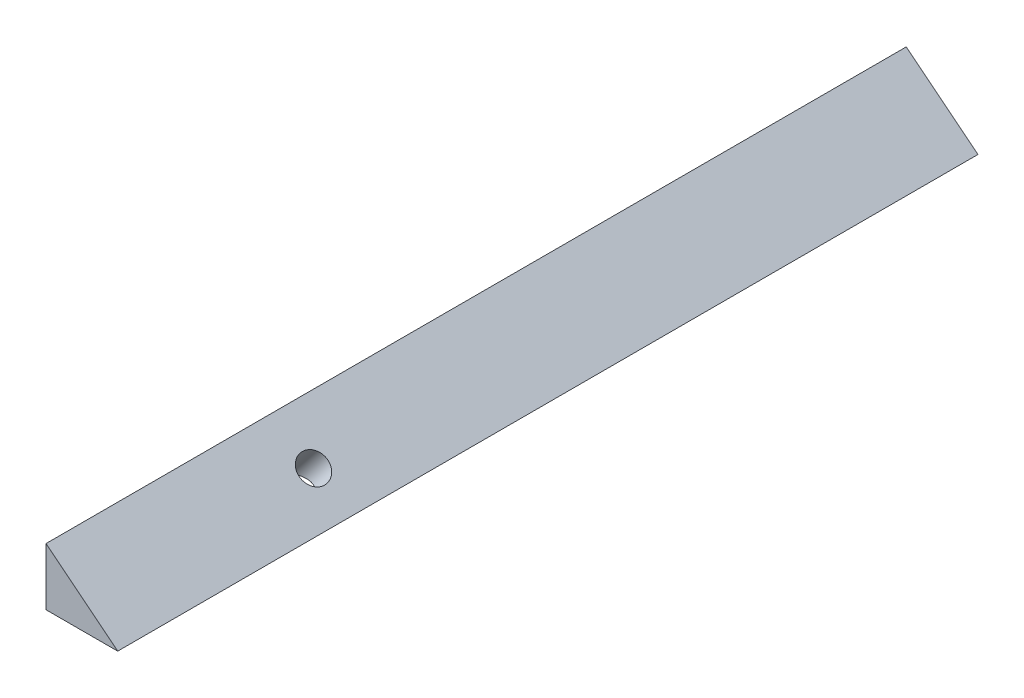
ISO-10303-21;
HEADER;
FILE_DESCRIPTION(('STEP AP214'),'2;1');
FILE_NAME('part.step','',(''),(''),'','','');
FILE_SCHEMA(('AUTOMOTIVE_DESIGN { 1 0 10303 214 1 1 1 1 }'));
ENDSEC;
DATA;
#1=APPLICATION_CONTEXT('core data for automotive mechanical design processes');
#2=APPLICATION_PROTOCOL_DEFINITION('international standard','automotive_design',2000,#1);
#3=PRODUCT_CONTEXT('',#1,'mechanical');
#4=PRODUCT('Part','Part','',(#3));
#5=PRODUCT_RELATED_PRODUCT_CATEGORY('part','',(#4));
#6=PRODUCT_DEFINITION_FORMATION('','',#4);
#7=PRODUCT_DEFINITION_CONTEXT('part definition',#1,'design');
#8=PRODUCT_DEFINITION('design','',#6,#7);
#9=PRODUCT_DEFINITION_SHAPE('','',#8);
#10=(LENGTH_UNIT() NAMED_UNIT(*) SI_UNIT(.MILLI.,.METRE.));
#11=(NAMED_UNIT(*) PLANE_ANGLE_UNIT() SI_UNIT($,.RADIAN.));
#12=(NAMED_UNIT(*) SI_UNIT($,.STERADIAN.) SOLID_ANGLE_UNIT());
#13=UNCERTAINTY_MEASURE_WITH_UNIT(LENGTH_MEASURE(1.E-05),#10,'distance_accuracy_value','');
#14=(GEOMETRIC_REPRESENTATION_CONTEXT(3) GLOBAL_UNCERTAINTY_ASSIGNED_CONTEXT((#13)) GLOBAL_UNIT_ASSIGNED_CONTEXT((#10,
#11,#12)) REPRESENTATION_CONTEXT('',''));
#15=CARTESIAN_POINT('',(0.,0.,0.));
#16=DIRECTION('',(0.,0.,1.));
#17=DIRECTION('',(1.,0.,0.));
#18=AXIS2_PLACEMENT_3D('',#15,#16,#17);
#19=CARTESIAN_POINT('',(0.,0.,-38.1));
#20=DIRECTION('',(1.,0.,0.));
#21=DIRECTION('',(0.,0.,-1.));
#22=AXIS2_PLACEMENT_3D('',#19,#20,#21);
#23=PLANE('',#22);
#24=DIRECTION('',(0.,0.,1.));
#25=VECTOR('',#24,1.);
#26=CARTESIAN_POINT('',(0.,0.,-38.1));
#27=LINE('',#26,#25);
#28=CARTESIAN_POINT('',(0.,0.,-469.9));
#29=VERTEX_POINT('',#28);
#30=CARTESIAN_POINT('',(0.,0.,83.4795863754));
#31=VERTEX_POINT('',#30);
#32=EDGE_CURVE('E93',#29,#31,#27,.T.);
#33=ORIENTED_EDGE('',*,*,#32,.T.);
#34=CARTESIAN_POINT('',(0.,-18.385241638452,88.9));
#35=DIRECTION('',(1.,0.,0.));
#36=DIRECTION('',(0.,1.,0.));
#37=AXIS2_PLACEMENT_3D('',#34,#35,#36);
#38=ELLIPSE('',#37,20.3299194538493,12.7);
#39=CARTESIAN_POINT('',(0.,0.,94.3204136245998));
#40=VERTEX_POINT('',#39);
#41=EDGE_CURVE('E60',#31,#40,#38,.T.);
#42=ORIENTED_EDGE('',*,*,#41,.T.);
#43=CARTESIAN_POINT('',(0.,0.,292.1));
#44=VERTEX_POINT('',#43);
#45=EDGE_CURVE('E90',#40,#44,#27,.T.);
#46=ORIENTED_EDGE('',*,*,#45,.T.);
#47=DIRECTION('',(0.,-1.,0.));
#48=VECTOR('',#47,1.);
#49=CARTESIAN_POINT('',(0.,50.8,292.1));
#50=LINE('',#49,#48);
#51=CARTESIAN_POINT('',(0.,50.8,292.1));
#52=VERTEX_POINT('',#51);
#53=EDGE_CURVE('E99',#52,#44,#50,.T.);
#54=ORIENTED_EDGE('',*,*,#53,.F.);
#55=DIRECTION('',(0.,0.,1.));
#56=VECTOR('',#55,1.);
#57=CARTESIAN_POINT('',(0.,50.8,-38.1));
#58=LINE('',#57,#56);
#59=CARTESIAN_POINT('',(0.,50.8,-469.9));
#60=VERTEX_POINT('',#59);
#61=EDGE_CURVE('E55',#60,#52,#58,.T.);
#62=ORIENTED_EDGE('',*,*,#61,.F.);
#63=DIRECTION('',(0.,1.,0.));
#64=VECTOR('',#63,1.);
#65=CARTESIAN_POINT('',(0.,0.,-469.9));
#66=LINE('',#65,#64);
#67=EDGE_CURVE('E94',#29,#60,#66,.T.);
#68=ORIENTED_EDGE('',*,*,#67,.F.);
#69=EDGE_LOOP('',(#33,#42,#46,#54,#62,#68));
#70=FACE_BOUND('',#69,.T.);
#71=ADVANCED_FACE('F48',(#70),#23,.F.);
#72=CARTESIAN_POINT('',(24.7804878048781,30.9756097560976,-38.1));
#73=DIRECTION('',(0.624695047554424,0.78086880944303,0.));
#74=DIRECTION('',(-0.78086880944303,0.624695047554424,0.));
#75=AXIS2_PLACEMENT_3D('',#72,#73,#74);
#76=PLANE('',#75);
#77=CARTESIAN_POINT('',(33.7488983602206,23.8008813118236,88.9));
#78=DIRECTION('',(0.624695047554424,0.78086880944303,0.));
#79=DIRECTION('',(-0.78086880944303,0.624695047554424,0.));
#80=AXIS2_PLACEMENT_3D('',#77,#78,#79);
#81=CIRCLE('',#80,12.7);
#82=CARTESIAN_POINT('',(23.8318644802941,31.7345084157648,88.9));
#83=VERTEX_POINT('',#82);
#84=EDGE_CURVE('E95',#83,#83,#81,.T.);
#85=ORIENTED_EDGE('',*,*,#84,.F.);
#86=EDGE_LOOP('',(#85));
#87=FACE_BOUND('',#86,.T.);
#88=ORIENTED_EDGE('',*,*,#61,.T.);
#89=DIRECTION('',(-0.78086880944303,0.624695047554424,0.));
#90=VECTOR('',#89,1.);
#91=CARTESIAN_POINT('',(63.5,0.,292.1));
#92=LINE('',#91,#90);
#93=CARTESIAN_POINT('',(63.5,0.,292.1));
#94=VERTEX_POINT('',#93);
#95=EDGE_CURVE('E105',#94,#52,#92,.T.);
#96=ORIENTED_EDGE('',*,*,#95,.F.);
#97=DIRECTION('',(0.,0.,1.));
#98=VECTOR('',#97,1.);
#99=CARTESIAN_POINT('',(63.5,0.,-38.1));
#100=LINE('',#99,#98);
#101=CARTESIAN_POINT('',(63.5,0.,-469.9));
#102=VERTEX_POINT('',#101);
#103=EDGE_CURVE('E68',#102,#94,#100,.T.);
#104=ORIENTED_EDGE('',*,*,#103,.F.);
#105=DIRECTION('',(0.78086880944303,-0.624695047554424,0.));
#106=VECTOR('',#105,1.);
#107=CARTESIAN_POINT('',(0.,50.8,-469.9));
#108=LINE('',#107,#106);
#109=EDGE_CURVE('E111',#60,#102,#108,.T.);
#110=ORIENTED_EDGE('',*,*,#109,.F.);
#111=EDGE_LOOP('',(#88,#96,#104,#110));
#112=FACE_BOUND('',#111,.T.);
#113=ADVANCED_FACE('F120',(#87,#112),#76,.T.);
#114=CARTESIAN_POINT('',(0.,0.,-38.1));
#115=DIRECTION('',(0.,-1.,0.));
#116=DIRECTION('',(0.,0.,-1.));
#117=AXIS2_PLACEMENT_3D('',#114,#115,#116);
#118=PLANE('',#117);
#119=CARTESIAN_POINT('',(14.7081933107616,0.,88.9));
#120=DIRECTION('',(0.,-1.,0.));
#121=DIRECTION('',(1.,0.,0.));
#122=AXIS2_PLACEMENT_3D('',#119,#120,#121);
#123=ELLIPSE('',#122,16.2639355630794,12.7);
#124=EDGE_CURVE('E13',#31,#40,#123,.T.);
#125=ORIENTED_EDGE('',*,*,#124,.F.);
#126=ORIENTED_EDGE('',*,*,#32,.F.);
#127=DIRECTION('',(-1.,0.,0.));
#128=VECTOR('',#127,1.);
#129=CARTESIAN_POINT('',(63.5,0.,-469.9));
#130=LINE('',#129,#128);
#131=EDGE_CURVE('E108',#102,#29,#130,.T.);
#132=ORIENTED_EDGE('',*,*,#131,.F.);
#133=ORIENTED_EDGE('',*,*,#103,.T.);
#134=DIRECTION('',(1.,0.,0.));
#135=VECTOR('',#134,1.);
#136=CARTESIAN_POINT('',(0.,0.,292.1));
#137=LINE('',#136,#135);
#138=EDGE_CURVE('E98',#44,#94,#137,.T.);
#139=ORIENTED_EDGE('',*,*,#138,.F.);
#140=ORIENTED_EDGE('',*,*,#45,.F.);
#141=EDGE_LOOP('',(#125,#126,#132,#133,#139,#140));
#142=FACE_BOUND('',#141,.T.);
#143=ADVANCED_FACE('F97',(#142),#118,.T.);
#144=CARTESIAN_POINT('',(0.,0.,292.1));
#145=DIRECTION('',(0.,0.,1.));
#146=DIRECTION('',(1.,0.,0.));
#147=AXIS2_PLACEMENT_3D('',#144,#145,#146);
#148=PLANE('',#147);
#149=ORIENTED_EDGE('',*,*,#95,.T.);
#150=ORIENTED_EDGE('',*,*,#53,.T.);
#151=ORIENTED_EDGE('',*,*,#138,.T.);
#152=EDGE_LOOP('',(#149,#150,#151));
#153=FACE_BOUND('',#152,.T.);
#154=ADVANCED_FACE('F127',(#153),#148,.T.);
#155=CARTESIAN_POINT('',(0.,0.,-469.9));
#156=DIRECTION('',(0.,0.,1.));
#157=DIRECTION('',(1.,0.,0.));
#158=AXIS2_PLACEMENT_3D('',#155,#156,#157);
#159=PLANE('',#158);
#160=ORIENTED_EDGE('',*,*,#67,.T.);
#161=ORIENTED_EDGE('',*,*,#109,.T.);
#162=ORIENTED_EDGE('',*,*,#131,.T.);
#163=EDGE_LOOP('',(#160,#161,#162));
#164=FACE_BOUND('',#163,.T.);
#165=ADVANCED_FACE('F129',(#164),#159,.F.);
#166=CARTESIAN_POINT('',(-235.99442317378,-313.378270605677,88.9));
#167=DIRECTION('',(0.624695047554424,0.78086880944303,0.));
#168=DIRECTION('',(-0.78086880944303,0.624695047554424,0.));
#169=AXIS2_PLACEMENT_3D('',#166,#167,#168);
#170=CYLINDRICAL_SURFACE('',#169,12.7);
#171=ORIENTED_EDGE('',*,*,#84,.T.);
#172=EDGE_LOOP('',(#171));
#173=FACE_BOUND('',#172,.T.);
#174=ORIENTED_EDGE('',*,*,#124,.T.);
#175=ORIENTED_EDGE('',*,*,#41,.F.);
#176=EDGE_LOOP('',(#174,#175));
#177=FACE_BOUND('',#176,.T.);
#178=ADVANCED_FACE('F85',(#173,#177),#170,.F.);
#179=CLOSED_SHELL('',(#71,#113,#143,#154,#165,#178));
#180=MANIFOLD_SOLID_BREP('B2',#179);
#181=ADVANCED_BREP_SHAPE_REPRESENTATION('',(#18,#180),#14);
#182=SHAPE_DEFINITION_REPRESENTATION(#9,#181);
ENDSEC;
END-ISO-10303-21;
